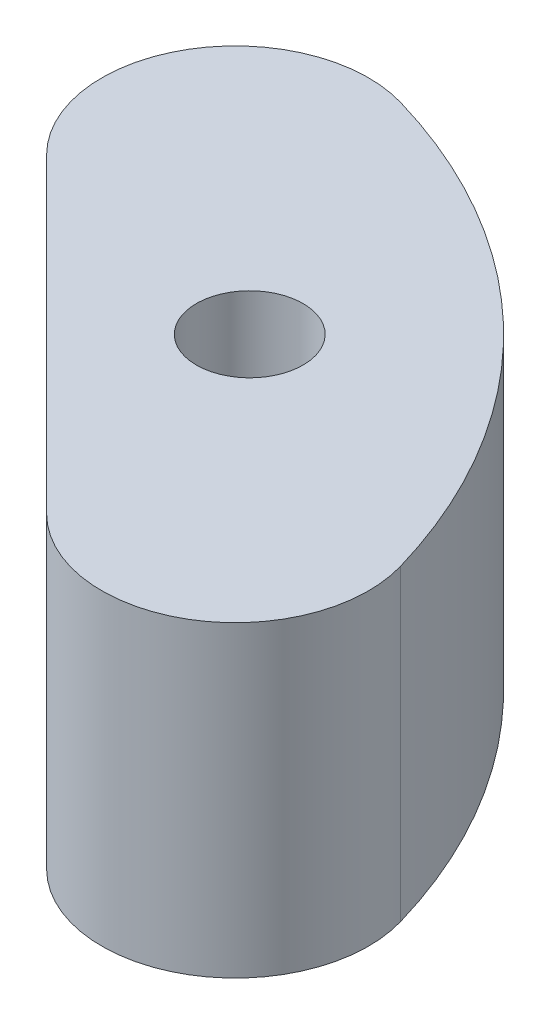
ISO-10303-21;
HEADER;
FILE_DESCRIPTION(('STEP AP214'),'2;1');
FILE_NAME('part.step','',(''),(''),'','','');
FILE_SCHEMA(('AUTOMOTIVE_DESIGN { 1 0 10303 214 1 1 1 1 }'));
ENDSEC;
DATA;
#1=APPLICATION_CONTEXT('core data for automotive mechanical design processes');
#2=APPLICATION_PROTOCOL_DEFINITION('international standard','automotive_design',2000,#1);
#3=PRODUCT_CONTEXT('',#1,'mechanical');
#4=PRODUCT('Part','Part','',(#3));
#5=PRODUCT_RELATED_PRODUCT_CATEGORY('part','',(#4));
#6=PRODUCT_DEFINITION_FORMATION('','',#4);
#7=PRODUCT_DEFINITION_CONTEXT('part definition',#1,'design');
#8=PRODUCT_DEFINITION('design','',#6,#7);
#9=PRODUCT_DEFINITION_SHAPE('','',#8);
#10=(LENGTH_UNIT() NAMED_UNIT(*) SI_UNIT(.MILLI.,.METRE.));
#11=(NAMED_UNIT(*) PLANE_ANGLE_UNIT() SI_UNIT($,.RADIAN.));
#12=(NAMED_UNIT(*) SI_UNIT($,.STERADIAN.) SOLID_ANGLE_UNIT());
#13=UNCERTAINTY_MEASURE_WITH_UNIT(LENGTH_MEASURE(1.E-05),#10,'distance_accuracy_value','');
#14=(GEOMETRIC_REPRESENTATION_CONTEXT(3) GLOBAL_UNCERTAINTY_ASSIGNED_CONTEXT((#13)) GLOBAL_UNIT_ASSIGNED_CONTEXT((#10,
#11,#12)) REPRESENTATION_CONTEXT('',''));
#15=CARTESIAN_POINT('',(0.,0.,0.));
#16=DIRECTION('',(0.,0.,1.));
#17=DIRECTION('',(1.,0.,0.));
#18=AXIS2_PLACEMENT_3D('',#15,#16,#17);
#19=CARTESIAN_POINT('',(0.,9.525,0.));
#20=DIRECTION('',(0.,1.,0.));
#21=DIRECTION('',(0.,0.,1.));
#22=AXIS2_PLACEMENT_3D('',#19,#20,#21);
#23=PLANE('',#22);
#24=DIRECTION('',(0.707106781186548,0.,0.707106781186547));
#25=VECTOR('',#24,1.);
#26=CARTESIAN_POINT('',(-11.3537211967283,9.525,-34.7023871115081));
#27=LINE('',#26,#25);
#28=CARTESIAN_POINT('',(2.05193509485064,9.525,-21.2967308199291));
#29=VERTEX_POINT('',#28);
#30=CARTESIAN_POINT('',(21.2967308199291,9.525,-2.05193509485065));
#31=VERTEX_POINT('',#30);
#32=EDGE_CURVE('E109',#29,#31,#27,.T.);
#33=ORIENTED_EDGE('',*,*,#32,.T.);
#34=CARTESIAN_POINT('',(27.1338972986241,9.525,-7.8891015735456));
#35=DIRECTION('',(0.,1.,0.));
#36=DIRECTION('',(0.,0.,1.));
#37=AXIS2_PLACEMENT_3D('',#34,#35,#36);
#38=CIRCLE('',#37,8.255);
#39=CARTESIAN_POINT('',(35.0606538128289,9.525,-10.1937829321095));
#40=VERTEX_POINT('',#39);
#41=EDGE_CURVE('E11',#31,#40,#38,.T.);
#42=ORIENTED_EDGE('',*,*,#41,.T.);
#43=CARTESIAN_POINT('',(0.,9.525,0.));
#44=DIRECTION('',(0.,1.,0.));
#45=DIRECTION('',(0.,0.,1.));
#46=AXIS2_PLACEMENT_3D('',#43,#44,#45);
#47=CIRCLE('',#46,36.5125);
#48=CARTESIAN_POINT('',(10.1937829321095,9.525,-35.0606538128289));
#49=VERTEX_POINT('',#48);
#50=EDGE_CURVE('E96',#40,#49,#47,.T.);
#51=ORIENTED_EDGE('',*,*,#50,.T.);
#52=CARTESIAN_POINT('',(7.88910157354559,9.525,-27.1338972986241));
#53=DIRECTION('',(0.,1.,0.));
#54=DIRECTION('',(0.,0.,1.));
#55=AXIS2_PLACEMENT_3D('',#52,#53,#54);
#56=CIRCLE('',#55,8.255);
#57=EDGE_CURVE('E47',#49,#29,#56,.T.);
#58=ORIENTED_EDGE('',*,*,#57,.T.);
#59=EDGE_LOOP('',(#33,#42,#51,#58));
#60=FACE_BOUND('',#59,.T.);
#61=CARTESIAN_POINT('',(17.9605122421383,9.525,-17.9605122421383));
#62=DIRECTION('',(0.,1.,0.));
#63=DIRECTION('',(0.,0.,1.));
#64=AXIS2_PLACEMENT_3D('',#61,#62,#63);
#65=CIRCLE('',#64,3.302);
#66=CARTESIAN_POINT('',(17.9605122421383,9.525,-14.6585122421383));
#67=VERTEX_POINT('',#66);
#68=EDGE_CURVE('E102',#67,#67,#65,.T.);
#69=ORIENTED_EDGE('',*,*,#68,.F.);
#70=EDGE_LOOP('',(#69));
#71=FACE_BOUND('',#70,.T.);
#72=ADVANCED_FACE('F39',(#60,#71),#23,.T.);
#73=CARTESIAN_POINT('',(0.,-9.525,0.));
#74=DIRECTION('',(0.,1.,0.));
#75=DIRECTION('',(0.,0.,1.));
#76=AXIS2_PLACEMENT_3D('',#73,#74,#75);
#77=PLANE('',#76);
#78=CARTESIAN_POINT('',(0.,-9.525,0.));
#79=DIRECTION('',(0.,1.,0.));
#80=DIRECTION('',(0.,0.,1.));
#81=AXIS2_PLACEMENT_3D('',#78,#79,#80);
#82=CIRCLE('',#81,36.5125);
#83=CARTESIAN_POINT('',(35.0606538128289,-9.525,-10.1937829321095));
#84=VERTEX_POINT('',#83);
#85=CARTESIAN_POINT('',(10.1937829321095,-9.525,-35.0606538128289));
#86=VERTEX_POINT('',#85);
#87=EDGE_CURVE('E94',#84,#86,#82,.T.);
#88=ORIENTED_EDGE('',*,*,#87,.F.);
#89=CARTESIAN_POINT('',(27.1338972986241,-9.525,-7.8891015735456));
#90=DIRECTION('',(0.,1.,0.));
#91=DIRECTION('',(0.,0.,1.));
#92=AXIS2_PLACEMENT_3D('',#89,#90,#91);
#93=CIRCLE('',#92,8.255);
#94=CARTESIAN_POINT('',(21.2967308199291,-9.525,-2.05193509485065));
#95=VERTEX_POINT('',#94);
#96=EDGE_CURVE('E79',#84,#95,#93,.F.);
#97=ORIENTED_EDGE('',*,*,#96,.T.);
#98=DIRECTION('',(0.707106781186548,0.,0.707106781186547));
#99=VECTOR('',#98,1.);
#100=CARTESIAN_POINT('',(-11.3537211967283,-9.525,-34.7023871115081));
#101=LINE('',#100,#99);
#102=CARTESIAN_POINT('',(2.05193509485064,-9.525,-21.2967308199291));
#103=VERTEX_POINT('',#102);
#104=EDGE_CURVE('E101',#103,#95,#101,.T.);
#105=ORIENTED_EDGE('',*,*,#104,.F.);
#106=CARTESIAN_POINT('',(7.88910157354559,-9.525,-27.1338972986241));
#107=DIRECTION('',(0.,1.,0.));
#108=DIRECTION('',(0.,0.,1.));
#109=AXIS2_PLACEMENT_3D('',#106,#107,#108);
#110=CIRCLE('',#109,8.255);
#111=EDGE_CURVE('E88',#103,#86,#110,.F.);
#112=ORIENTED_EDGE('',*,*,#111,.T.);
#113=EDGE_LOOP('',(#88,#97,#105,#112));
#114=FACE_BOUND('',#113,.T.);
#115=CARTESIAN_POINT('',(17.9605122421383,-9.525,-17.9605122421383));
#116=DIRECTION('',(0.,1.,0.));
#117=DIRECTION('',(0.,0.,1.));
#118=AXIS2_PLACEMENT_3D('',#115,#116,#117);
#119=CIRCLE('',#118,3.302);
#120=CARTESIAN_POINT('',(17.9605122421383,-9.525,-14.6585122421383));
#121=VERTEX_POINT('',#120);
#122=EDGE_CURVE('E106',#121,#121,#119,.T.);
#123=ORIENTED_EDGE('',*,*,#122,.T.);
#124=EDGE_LOOP('',(#123));
#125=FACE_BOUND('',#124,.T.);
#126=ADVANCED_FACE('F99',(#114,#125),#77,.F.);
#127=CARTESIAN_POINT('',(0.,9.525,0.));
#128=DIRECTION('',(0.,-1.,0.));
#129=DIRECTION('',(0.,0.,-1.));
#130=AXIS2_PLACEMENT_3D('',#127,#128,#129);
#131=CYLINDRICAL_SURFACE('',#130,36.5125);
#132=ORIENTED_EDGE('',*,*,#50,.F.);
#133=DIRECTION('',(0.,-1.,0.));
#134=VECTOR('',#133,1.);
#135=CARTESIAN_POINT('',(35.0606538128289,9.525,-10.1937829321095));
#136=LINE('',#135,#134);
#137=EDGE_CURVE('E83',#40,#84,#136,.T.);
#138=ORIENTED_EDGE('',*,*,#137,.T.);
#139=ORIENTED_EDGE('',*,*,#87,.T.);
#140=DIRECTION('',(0.,-1.,0.));
#141=VECTOR('',#140,1.);
#142=CARTESIAN_POINT('',(10.1937829321095,9.525,-35.0606538128289));
#143=LINE('',#142,#141);
#144=EDGE_CURVE('E97',#86,#49,#143,.F.);
#145=ORIENTED_EDGE('',*,*,#144,.T.);
#146=EDGE_LOOP('',(#132,#138,#139,#145));
#147=FACE_BOUND('',#146,.T.);
#148=ADVANCED_FACE('F93',(#147),#131,.T.);
#149=CARTESIAN_POINT('',(-11.3537211967283,9.525,-34.7023871115081));
#150=DIRECTION('',(0.707106781186547,0.,-0.707106781186548));
#151=DIRECTION('',(-0.707106781186548,0.,-0.707106781186547));
#152=AXIS2_PLACEMENT_3D('',#149,#150,#151);
#153=PLANE('',#152);
#154=CARTESIAN_POINT('',(18.7241875651127,-6.249999946,-4.62447834966712));
#155=DIRECTION('',(-0.707106781186547,0.,0.707106781186548));
#156=DIRECTION('',(0.707106781186548,0.,0.707106781186547));
#157=AXIS2_PLACEMENT_3D('',#154,#155,#156);
#158=CIRCLE('',#157,1.950000037);
#159=CARTESIAN_POINT('',(20.1030458145894,-6.249999946,-3.2456201001904));
#160=VERTEX_POINT('',#159);
#161=EDGE_CURVE('E133',#160,#160,#158,.T.);
#162=ORIENTED_EDGE('',*,*,#161,.F.);
#163=EDGE_LOOP('',(#162));
#164=FACE_BOUND('',#163,.T.);
#165=CARTESIAN_POINT('',(4.62447834966712,-6.249999946,-18.7241875651127));
#166=DIRECTION('',(-0.707106781186547,0.,0.707106781186548));
#167=DIRECTION('',(0.707106781186548,0.,0.707106781186547));
#168=AXIS2_PLACEMENT_3D('',#165,#166,#167);
#169=CIRCLE('',#168,1.950000037);
#170=CARTESIAN_POINT('',(6.00333659914384,-6.249999946,-17.3453293156359));
#171=VERTEX_POINT('',#170);
#172=EDGE_CURVE('E139',#171,#171,#169,.T.);
#173=ORIENTED_EDGE('',*,*,#172,.F.);
#174=EDGE_LOOP('',(#173));
#175=FACE_BOUND('',#174,.T.);
#176=CARTESIAN_POINT('',(4.62447834966712,6.249999946,-18.7241875651127));
#177=DIRECTION('',(-0.707106781186547,0.,0.707106781186548));
#178=DIRECTION('',(0.707106781186548,0.,0.707106781186547));
#179=AXIS2_PLACEMENT_3D('',#176,#177,#178);
#180=CIRCLE('',#179,1.950000037);
#181=CARTESIAN_POINT('',(6.00333659914384,6.249999946,-17.3453293156359));
#182=VERTEX_POINT('',#181);
#183=EDGE_CURVE('E127',#182,#182,#180,.T.);
#184=ORIENTED_EDGE('',*,*,#183,.F.);
#185=EDGE_LOOP('',(#184));
#186=FACE_BOUND('',#185,.T.);
#187=CARTESIAN_POINT('',(18.7241875651127,6.249999946,-4.62447834966712));
#188=DIRECTION('',(-0.707106781186547,0.,0.707106781186548));
#189=DIRECTION('',(0.707106781186548,0.,0.707106781186547));
#190=AXIS2_PLACEMENT_3D('',#187,#188,#189);
#191=CIRCLE('',#190,1.950000037);
#192=CARTESIAN_POINT('',(20.1030458145894,6.249999946,-3.24562010019041));
#193=VERTEX_POINT('',#192);
#194=EDGE_CURVE('E124',#193,#193,#191,.T.);
#195=ORIENTED_EDGE('',*,*,#194,.F.);
#196=EDGE_LOOP('',(#195));
#197=FACE_BOUND('',#196,.T.);
#198=ORIENTED_EDGE('',*,*,#104,.T.);
#199=DIRECTION('',(0.,-1.,0.));
#200=VECTOR('',#199,1.);
#201=CARTESIAN_POINT('',(21.2967308199291,9.525,-2.05193509485065));
#202=LINE('',#201,#200);
#203=EDGE_CURVE('E54',#95,#31,#202,.F.);
#204=ORIENTED_EDGE('',*,*,#203,.T.);
#205=ORIENTED_EDGE('',*,*,#32,.F.);
#206=DIRECTION('',(0.,-1.,0.));
#207=VECTOR('',#206,1.);
#208=CARTESIAN_POINT('',(2.05193509485064,9.525,-21.2967308199291));
#209=LINE('',#208,#207);
#210=EDGE_CURVE('E87',#29,#103,#209,.T.);
#211=ORIENTED_EDGE('',*,*,#210,.T.);
#212=EDGE_LOOP('',(#198,#204,#205,#211));
#213=FACE_BOUND('',#212,.T.);
#214=ADVANCED_FACE('F117',(#164,#175,#186,#197,#213),#153,.F.);
#215=CARTESIAN_POINT('',(17.9605122421383,9.525,-17.9605122421383));
#216=DIRECTION('',(0.,-1.,0.));
#217=DIRECTION('',(0.,0.,-1.));
#218=AXIS2_PLACEMENT_3D('',#215,#216,#217);
#219=CYLINDRICAL_SURFACE('',#218,3.302);
#220=ORIENTED_EDGE('',*,*,#68,.T.);
#221=EDGE_LOOP('',(#220));
#222=FACE_BOUND('',#221,.T.);
#223=ORIENTED_EDGE('',*,*,#122,.F.);
#224=EDGE_LOOP('',(#223));
#225=FACE_BOUND('',#224,.T.);
#226=ADVANCED_FACE('F152',(#222,#225),#219,.F.);
#227=CARTESIAN_POINT('',(22.8254069553916,6.249999946,-8.72569773994607));
#228=DIRECTION('',(-0.707106781186547,0.,0.707106781186548));
#229=DIRECTION('',(0.707106781186548,0.,0.707106781186547));
#230=AXIS2_PLACEMENT_3D('',#227,#228,#229);
#231=CYLINDRICAL_SURFACE('',#230,1.950000037);
#232=CARTESIAN_POINT('',(22.8254069553916,6.249999946,-8.72569773994607));
#233=DIRECTION('',(-0.707106781186547,0.,0.707106781186548));
#234=DIRECTION('',(0.707106781186548,0.,0.707106781186547));
#235=AXIS2_PLACEMENT_3D('',#232,#233,#234);
#236=CIRCLE('',#235,1.950000037);
#237=CARTESIAN_POINT('',(24.2042652048683,6.249999946,-7.34683949046935));
#238=VERTEX_POINT('',#237);
#239=EDGE_CURVE('E122',#238,#238,#236,.T.);
#240=ORIENTED_EDGE('',*,*,#239,.F.);
#241=EDGE_LOOP('',(#240));
#242=FACE_BOUND('',#241,.T.);
#243=ORIENTED_EDGE('',*,*,#194,.T.);
#244=EDGE_LOOP('',(#243));
#245=FACE_BOUND('',#244,.T.);
#246=ADVANCED_FACE('F157',(#242,#245),#231,.F.);
#247=CARTESIAN_POINT('',(22.8254069553916,6.249999946,-8.72569773994607));
#248=DIRECTION('',(-0.707106781186547,0.,0.707106781186548));
#249=DIRECTION('',(0.707106781186548,0.,0.707106781186547));
#250=AXIS2_PLACEMENT_3D('',#247,#248,#249);
#251=PLANE('',#250);
#252=ORIENTED_EDGE('',*,*,#239,.T.);
#253=EDGE_LOOP('',(#252));
#254=FACE_BOUND('',#253,.T.);
#255=ADVANCED_FACE('F159',(#254),#251,.T.);
#256=CARTESIAN_POINT('',(8.72569773994607,6.249999946,-22.8254069553916));
#257=DIRECTION('',(-0.707106781186547,0.,0.707106781186548));
#258=DIRECTION('',(0.707106781186548,0.,0.707106781186547));
#259=AXIS2_PLACEMENT_3D('',#256,#257,#258);
#260=CYLINDRICAL_SURFACE('',#259,1.950000037);
#261=CARTESIAN_POINT('',(8.72569773994607,6.249999946,-22.8254069553916));
#262=DIRECTION('',(-0.707106781186547,0.,0.707106781186548));
#263=DIRECTION('',(0.707106781186548,0.,0.707106781186547));
#264=AXIS2_PLACEMENT_3D('',#261,#262,#263);
#265=CIRCLE('',#264,1.950000037);
#266=CARTESIAN_POINT('',(10.1045559894228,6.249999946,-21.4465487059149));
#267=VERTEX_POINT('',#266);
#268=EDGE_CURVE('E142',#267,#267,#265,.T.);
#269=ORIENTED_EDGE('',*,*,#268,.F.);
#270=EDGE_LOOP('',(#269));
#271=FACE_BOUND('',#270,.T.);
#272=ORIENTED_EDGE('',*,*,#183,.T.);
#273=EDGE_LOOP('',(#272));
#274=FACE_BOUND('',#273,.T.);
#275=ADVANCED_FACE('F148',(#271,#274),#260,.F.);
#276=CARTESIAN_POINT('',(8.72569773994607,6.249999946,-22.8254069553916));
#277=DIRECTION('',(-0.707106781186547,0.,0.707106781186548));
#278=DIRECTION('',(0.707106781186548,0.,0.707106781186547));
#279=AXIS2_PLACEMENT_3D('',#276,#277,#278);
#280=PLANE('',#279);
#281=ORIENTED_EDGE('',*,*,#268,.T.);
#282=EDGE_LOOP('',(#281));
#283=FACE_BOUND('',#282,.T.);
#284=ADVANCED_FACE('F201',(#283),#280,.T.);
#285=CARTESIAN_POINT('',(8.72569773994607,-6.249999946,-22.8254069553916));
#286=DIRECTION('',(-0.707106781186547,0.,0.707106781186548));
#287=DIRECTION('',(0.707106781186548,0.,0.707106781186547));
#288=AXIS2_PLACEMENT_3D('',#285,#286,#287);
#289=CYLINDRICAL_SURFACE('',#288,1.950000037);
#290=CARTESIAN_POINT('',(8.72569773994607,-6.249999946,-22.8254069553916));
#291=DIRECTION('',(-0.707106781186547,0.,0.707106781186548));
#292=DIRECTION('',(0.707106781186548,0.,0.707106781186547));
#293=AXIS2_PLACEMENT_3D('',#290,#291,#292);
#294=CIRCLE('',#293,1.950000037);
#295=CARTESIAN_POINT('',(10.1045559894228,-6.249999946,-21.4465487059149));
#296=VERTEX_POINT('',#295);
#297=EDGE_CURVE('E136',#296,#296,#294,.T.);
#298=ORIENTED_EDGE('',*,*,#297,.F.);
#299=EDGE_LOOP('',(#298));
#300=FACE_BOUND('',#299,.T.);
#301=ORIENTED_EDGE('',*,*,#172,.T.);
#302=EDGE_LOOP('',(#301));
#303=FACE_BOUND('',#302,.T.);
#304=ADVANCED_FACE('F197',(#300,#303),#289,.F.);
#305=CARTESIAN_POINT('',(8.72569773994607,-6.249999946,-22.8254069553916));
#306=DIRECTION('',(-0.707106781186547,0.,0.707106781186548));
#307=DIRECTION('',(0.707106781186548,0.,0.707106781186547));
#308=AXIS2_PLACEMENT_3D('',#305,#306,#307);
#309=PLANE('',#308);
#310=ORIENTED_EDGE('',*,*,#297,.T.);
#311=EDGE_LOOP('',(#310));
#312=FACE_BOUND('',#311,.T.);
#313=ADVANCED_FACE('F191',(#312),#309,.T.);
#314=CARTESIAN_POINT('',(22.8254069553916,-6.249999946,-8.72569773994607));
#315=DIRECTION('',(-0.707106781186547,0.,0.707106781186548));
#316=DIRECTION('',(0.707106781186548,0.,0.707106781186547));
#317=AXIS2_PLACEMENT_3D('',#314,#315,#316);
#318=CYLINDRICAL_SURFACE('',#317,1.950000037);
#319=CARTESIAN_POINT('',(22.8254069553916,-6.249999946,-8.72569773994607));
#320=DIRECTION('',(-0.707106781186547,0.,0.707106781186548));
#321=DIRECTION('',(0.707106781186548,0.,0.707106781186547));
#322=AXIS2_PLACEMENT_3D('',#319,#320,#321);
#323=CIRCLE('',#322,1.950000037);
#324=CARTESIAN_POINT('',(24.2042652048683,-6.249999946,-7.34683949046935));
#325=VERTEX_POINT('',#324);
#326=EDGE_CURVE('E130',#325,#325,#323,.T.);
#327=ORIENTED_EDGE('',*,*,#326,.F.);
#328=EDGE_LOOP('',(#327));
#329=FACE_BOUND('',#328,.T.);
#330=ORIENTED_EDGE('',*,*,#161,.T.);
#331=EDGE_LOOP('',(#330));
#332=FACE_BOUND('',#331,.T.);
#333=ADVANCED_FACE('F185',(#329,#332),#318,.F.);
#334=CARTESIAN_POINT('',(22.8254069553916,-6.249999946,-8.72569773994607));
#335=DIRECTION('',(-0.707106781186547,0.,0.707106781186548));
#336=DIRECTION('',(0.707106781186548,0.,0.707106781186547));
#337=AXIS2_PLACEMENT_3D('',#334,#335,#336);
#338=PLANE('',#337);
#339=ORIENTED_EDGE('',*,*,#326,.T.);
#340=EDGE_LOOP('',(#339));
#341=FACE_BOUND('',#340,.T.);
#342=ADVANCED_FACE('F181',(#341),#338,.T.);
#343=CARTESIAN_POINT('',(27.1338972986241,9.525,-7.8891015735456));
#344=DIRECTION('',(0.,-1.,0.));
#345=DIRECTION('',(0.,0.,-1.));
#346=AXIS2_PLACEMENT_3D('',#343,#344,#345);
#347=CYLINDRICAL_SURFACE('',#346,8.255);
#348=ORIENTED_EDGE('',*,*,#41,.F.);
#349=ORIENTED_EDGE('',*,*,#203,.F.);
#350=ORIENTED_EDGE('',*,*,#96,.F.);
#351=ORIENTED_EDGE('',*,*,#137,.F.);
#352=EDGE_LOOP('',(#348,#349,#350,#351));
#353=FACE_BOUND('',#352,.T.);
#354=ADVANCED_FACE('F82',(#353),#347,.T.);
#355=CARTESIAN_POINT('',(7.88910157354559,9.525,-27.1338972986241));
#356=DIRECTION('',(0.,-1.,0.));
#357=DIRECTION('',(0.,0.,-1.));
#358=AXIS2_PLACEMENT_3D('',#355,#356,#357);
#359=CYLINDRICAL_SURFACE('',#358,8.255);
#360=ORIENTED_EDGE('',*,*,#57,.F.);
#361=ORIENTED_EDGE('',*,*,#144,.F.);
#362=ORIENTED_EDGE('',*,*,#111,.F.);
#363=ORIENTED_EDGE('',*,*,#210,.F.);
#364=EDGE_LOOP('',(#360,#361,#362,#363));
#365=FACE_BOUND('',#364,.T.);
#366=ADVANCED_FACE('F41',(#365),#359,.T.);
#367=CLOSED_SHELL('',(#72,#126,#148,#214,#226,#246,#255,#275,#284,#304,#313,#333,#342,#354,#366));
#368=MANIFOLD_SOLID_BREP('B2',#367);
#369=ADVANCED_BREP_SHAPE_REPRESENTATION('',(#18,#368),#14);
#370=SHAPE_DEFINITION_REPRESENTATION(#9,#369);
ENDSEC;
END-ISO-10303-21;
